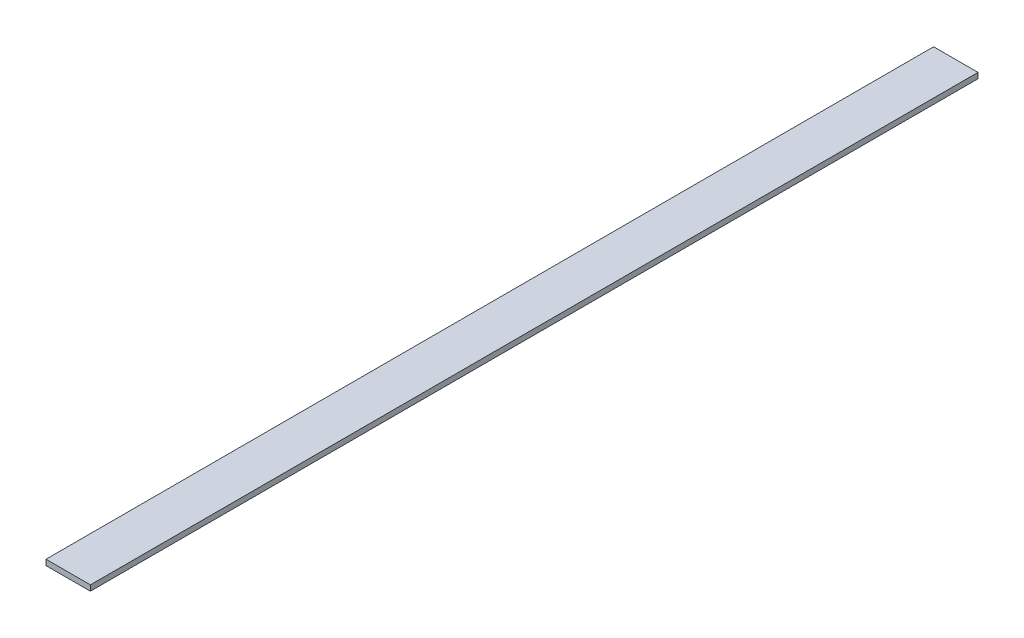
ISO-10303-21;
HEADER;
FILE_DESCRIPTION(('STEP AP214'),'2;1');
FILE_NAME('part.step','',(''),(''),'','','');
FILE_SCHEMA(('AUTOMOTIVE_DESIGN { 1 0 10303 214 1 1 1 1 }'));
ENDSEC;
DATA;
#1=APPLICATION_CONTEXT('core data for automotive mechanical design processes');
#2=APPLICATION_PROTOCOL_DEFINITION('international standard','automotive_design',2000,#1);
#3=PRODUCT_CONTEXT('',#1,'mechanical');
#4=PRODUCT('Part','Part','',(#3));
#5=PRODUCT_RELATED_PRODUCT_CATEGORY('part','',(#4));
#6=PRODUCT_DEFINITION_FORMATION('','',#4);
#7=PRODUCT_DEFINITION_CONTEXT('part definition',#1,'design');
#8=PRODUCT_DEFINITION('design','',#6,#7);
#9=PRODUCT_DEFINITION_SHAPE('','',#8);
#10=(LENGTH_UNIT() NAMED_UNIT(*) SI_UNIT(.MILLI.,.METRE.));
#11=(NAMED_UNIT(*) PLANE_ANGLE_UNIT() SI_UNIT($,.RADIAN.));
#12=(NAMED_UNIT(*) SI_UNIT($,.STERADIAN.) SOLID_ANGLE_UNIT());
#13=UNCERTAINTY_MEASURE_WITH_UNIT(LENGTH_MEASURE(1.E-05),#10,'distance_accuracy_value','');
#14=(GEOMETRIC_REPRESENTATION_CONTEXT(3) GLOBAL_UNCERTAINTY_ASSIGNED_CONTEXT((#13)) GLOBAL_UNIT_ASSIGNED_CONTEXT((#10,
#11,#12)) REPRESENTATION_CONTEXT('',''));
#15=CARTESIAN_POINT('',(0.,0.,0.));
#16=DIRECTION('',(0.,0.,1.));
#17=DIRECTION('',(1.,0.,0.));
#18=AXIS2_PLACEMENT_3D('',#15,#16,#17);
#19=CARTESIAN_POINT('',(101.6,12.7,0.));
#20=DIRECTION('',(0.,1.,0.));
#21=DIRECTION('',(0.,0.,1.));
#22=AXIS2_PLACEMENT_3D('',#19,#20,#21);
#23=PLANE('',#22);
#24=DIRECTION('',(0.,0.,-1.));
#25=VECTOR('',#24,1.);
#26=CARTESIAN_POINT('',(101.6,12.7,0.));
#27=LINE('',#26,#25);
#28=CARTESIAN_POINT('',(101.6,12.7,0.));
#29=VERTEX_POINT('',#28);
#30=CARTESIAN_POINT('',(101.6,12.7,2032.));
#31=VERTEX_POINT('',#30);
#32=EDGE_CURVE('E19',#29,#31,#27,.F.);
#33=ORIENTED_EDGE('',*,*,#32,.F.);
#34=DIRECTION('',(1.,0.,0.));
#35=VECTOR('',#34,1.);
#36=CARTESIAN_POINT('',(0.,12.7,0.));
#37=LINE('',#36,#35);
#38=CARTESIAN_POINT('',(0.,12.7,0.));
#39=VERTEX_POINT('',#38);
#40=EDGE_CURVE('E79',#29,#39,#37,.F.);
#41=ORIENTED_EDGE('',*,*,#40,.T.);
#42=DIRECTION('',(0.,0.,1.));
#43=VECTOR('',#42,1.);
#44=CARTESIAN_POINT('',(0.,12.7,0.));
#45=LINE('',#44,#43);
#46=CARTESIAN_POINT('',(0.,12.7,2032.));
#47=VERTEX_POINT('',#46);
#48=EDGE_CURVE('E67',#47,#39,#45,.F.);
#49=ORIENTED_EDGE('',*,*,#48,.F.);
#50=DIRECTION('',(1.,0.,0.));
#51=VECTOR('',#50,1.);
#52=CARTESIAN_POINT('',(0.,12.7,2032.));
#53=LINE('',#52,#51);
#54=EDGE_CURVE('E55',#31,#47,#53,.F.);
#55=ORIENTED_EDGE('',*,*,#54,.F.);
#56=EDGE_LOOP('',(#33,#41,#49,#55));
#57=FACE_BOUND('',#56,.T.);
#58=ADVANCED_FACE('F16',(#57),#23,.T.);
#59=CARTESIAN_POINT('',(101.6,0.,0.));
#60=DIRECTION('',(1.,0.,0.));
#61=DIRECTION('',(0.,0.,-1.));
#62=AXIS2_PLACEMENT_3D('',#59,#60,#61);
#63=PLANE('',#62);
#64=DIRECTION('',(0.,0.,-1.));
#65=VECTOR('',#64,1.);
#66=CARTESIAN_POINT('',(101.6,0.,0.));
#67=LINE('',#66,#65);
#68=CARTESIAN_POINT('',(101.6,0.,0.));
#69=VERTEX_POINT('',#68);
#70=CARTESIAN_POINT('',(101.6,0.,2032.));
#71=VERTEX_POINT('',#70);
#72=EDGE_CURVE('E82',#69,#71,#67,.F.);
#73=ORIENTED_EDGE('',*,*,#72,.F.);
#74=DIRECTION('',(0.,1.,0.));
#75=VECTOR('',#74,1.);
#76=CARTESIAN_POINT('',(101.6,0.,0.));
#77=LINE('',#76,#75);
#78=EDGE_CURVE('E64',#69,#29,#77,.T.);
#79=ORIENTED_EDGE('',*,*,#78,.T.);
#80=ORIENTED_EDGE('',*,*,#32,.T.);
#81=DIRECTION('',(0.,1.,0.));
#82=VECTOR('',#81,1.);
#83=CARTESIAN_POINT('',(101.6,0.,2032.));
#84=LINE('',#83,#82);
#85=EDGE_CURVE('E61',#71,#31,#84,.T.);
#86=ORIENTED_EDGE('',*,*,#85,.F.);
#87=EDGE_LOOP('',(#73,#79,#80,#86));
#88=FACE_BOUND('',#87,.T.);
#89=ADVANCED_FACE('F60',(#88),#63,.T.);
#90=CARTESIAN_POINT('',(0.,0.,2032.));
#91=DIRECTION('',(0.,0.,1.));
#92=DIRECTION('',(1.,0.,0.));
#93=AXIS2_PLACEMENT_3D('',#90,#91,#92);
#94=PLANE('',#93);
#95=DIRECTION('',(0.,1.,0.));
#96=VECTOR('',#95,1.);
#97=CARTESIAN_POINT('',(0.,12.7,2032.));
#98=LINE('',#97,#96);
#99=CARTESIAN_POINT('',(0.,0.,2032.));
#100=VERTEX_POINT('',#99);
#101=EDGE_CURVE('E69',#100,#47,#98,.T.);
#102=ORIENTED_EDGE('',*,*,#101,.F.);
#103=DIRECTION('',(1.,0.,0.));
#104=VECTOR('',#103,1.);
#105=CARTESIAN_POINT('',(0.,0.,2032.));
#106=LINE('',#105,#104);
#107=EDGE_CURVE('E73',#71,#100,#106,.F.);
#108=ORIENTED_EDGE('',*,*,#107,.F.);
#109=ORIENTED_EDGE('',*,*,#85,.T.);
#110=ORIENTED_EDGE('',*,*,#54,.T.);
#111=EDGE_LOOP('',(#102,#108,#109,#110));
#112=FACE_BOUND('',#111,.T.);
#113=ADVANCED_FACE('F71',(#112),#94,.T.);
#114=CARTESIAN_POINT('',(0.,12.7,0.));
#115=DIRECTION('',(-1.,0.,0.));
#116=DIRECTION('',(0.,0.,1.));
#117=AXIS2_PLACEMENT_3D('',#114,#115,#116);
#118=PLANE('',#117);
#119=ORIENTED_EDGE('',*,*,#48,.T.);
#120=DIRECTION('',(0.,1.,0.));
#121=VECTOR('',#120,1.);
#122=CARTESIAN_POINT('',(0.,0.,0.));
#123=LINE('',#122,#121);
#124=CARTESIAN_POINT('',(0.,0.,0.));
#125=VERTEX_POINT('',#124);
#126=EDGE_CURVE('E34',#39,#125,#123,.F.);
#127=ORIENTED_EDGE('',*,*,#126,.T.);
#128=DIRECTION('',(0.,0.,-1.));
#129=VECTOR('',#128,1.);
#130=CARTESIAN_POINT('',(0.,0.,0.));
#131=LINE('',#130,#129);
#132=EDGE_CURVE('E25',#100,#125,#131,.T.);
#133=ORIENTED_EDGE('',*,*,#132,.F.);
#134=ORIENTED_EDGE('',*,*,#101,.T.);
#135=EDGE_LOOP('',(#119,#127,#133,#134));
#136=FACE_BOUND('',#135,.T.);
#137=ADVANCED_FACE('F88',(#136),#118,.T.);
#138=CARTESIAN_POINT('',(0.,0.,0.));
#139=DIRECTION('',(0.,0.,1.));
#140=DIRECTION('',(1.,0.,0.));
#141=AXIS2_PLACEMENT_3D('',#138,#139,#140);
#142=PLANE('',#141);
#143=ORIENTED_EDGE('',*,*,#40,.F.);
#144=ORIENTED_EDGE('',*,*,#78,.F.);
#145=DIRECTION('',(1.,0.,0.));
#146=VECTOR('',#145,1.);
#147=CARTESIAN_POINT('',(0.,0.,0.));
#148=LINE('',#147,#146);
#149=EDGE_CURVE('E11',#125,#69,#148,.T.);
#150=ORIENTED_EDGE('',*,*,#149,.F.);
#151=ORIENTED_EDGE('',*,*,#126,.F.);
#152=EDGE_LOOP('',(#143,#144,#150,#151));
#153=FACE_BOUND('',#152,.T.);
#154=ADVANCED_FACE('F90',(#153),#142,.F.);
#155=CARTESIAN_POINT('',(0.,0.,0.));
#156=DIRECTION('',(0.,-1.,0.));
#157=DIRECTION('',(0.,0.,-1.));
#158=AXIS2_PLACEMENT_3D('',#155,#156,#157);
#159=PLANE('',#158);
#160=ORIENTED_EDGE('',*,*,#132,.T.);
#161=ORIENTED_EDGE('',*,*,#149,.T.);
#162=ORIENTED_EDGE('',*,*,#72,.T.);
#163=ORIENTED_EDGE('',*,*,#107,.T.);
#164=EDGE_LOOP('',(#160,#161,#162,#163));
#165=FACE_BOUND('',#164,.T.);
#166=ADVANCED_FACE('F87',(#165),#159,.T.);
#167=CLOSED_SHELL('',(#58,#89,#113,#137,#154,#166));
#168=MANIFOLD_SOLID_BREP('B1',#167);
#169=ADVANCED_BREP_SHAPE_REPRESENTATION('',(#18,#168),#14);
#170=SHAPE_DEFINITION_REPRESENTATION(#9,#169);
ENDSEC;
END-ISO-10303-21;
